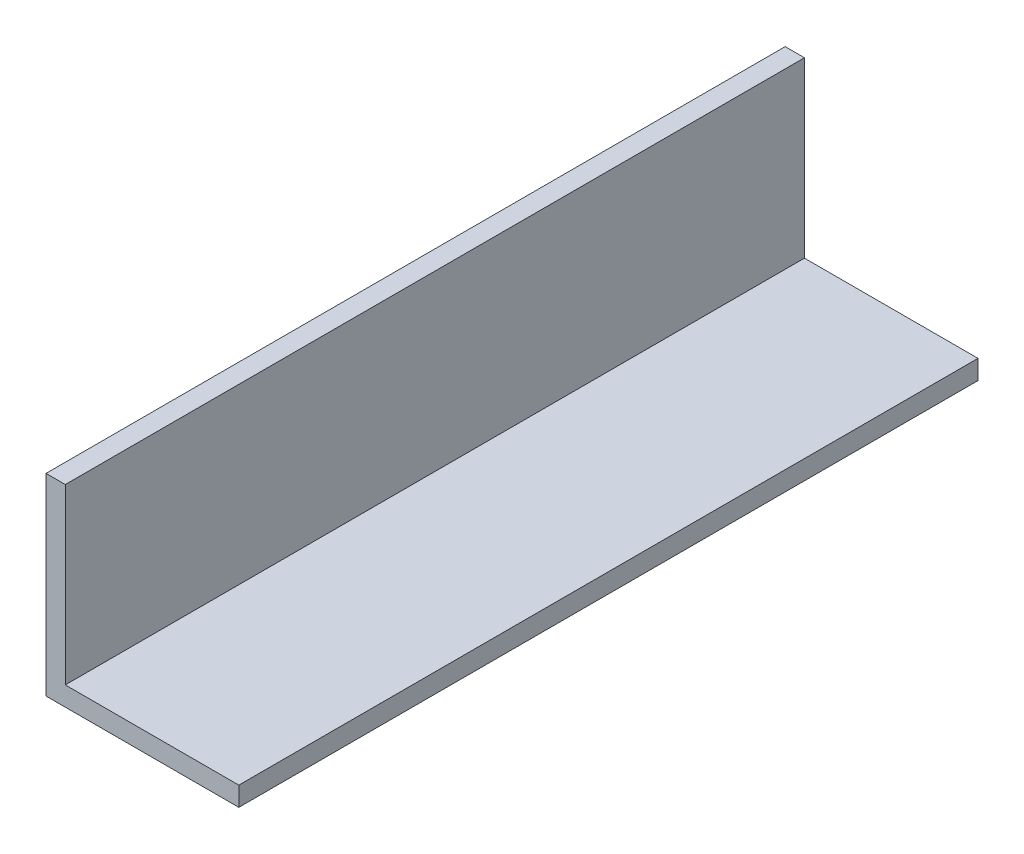
ISO-10303-21;
HEADER;
FILE_DESCRIPTION(('STEP AP214'),'2;1');
FILE_NAME('part.step','',(''),(''),'','','');
FILE_SCHEMA(('AUTOMOTIVE_DESIGN { 1 0 10303 214 1 1 1 1 }'));
ENDSEC;
DATA;
#1=APPLICATION_CONTEXT('core data for automotive mechanical design processes');
#2=APPLICATION_PROTOCOL_DEFINITION('international standard','automotive_design',2000,#1);
#3=PRODUCT_CONTEXT('',#1,'mechanical');
#4=PRODUCT('Part','Part','',(#3));
#5=PRODUCT_RELATED_PRODUCT_CATEGORY('part','',(#4));
#6=PRODUCT_DEFINITION_FORMATION('','',#4);
#7=PRODUCT_DEFINITION_CONTEXT('part definition',#1,'design');
#8=PRODUCT_DEFINITION('design','',#6,#7);
#9=PRODUCT_DEFINITION_SHAPE('','',#8);
#10=(LENGTH_UNIT() NAMED_UNIT(*) SI_UNIT(.MILLI.,.METRE.));
#11=(NAMED_UNIT(*) PLANE_ANGLE_UNIT() SI_UNIT($,.RADIAN.));
#12=(NAMED_UNIT(*) SI_UNIT($,.STERADIAN.) SOLID_ANGLE_UNIT());
#13=UNCERTAINTY_MEASURE_WITH_UNIT(LENGTH_MEASURE(1.E-05),#10,'distance_accuracy_value','');
#14=(GEOMETRIC_REPRESENTATION_CONTEXT(3) GLOBAL_UNCERTAINTY_ASSIGNED_CONTEXT((#13)) GLOBAL_UNIT_ASSIGNED_CONTEXT((#10,
#11,#12)) REPRESENTATION_CONTEXT('',''));
#15=CARTESIAN_POINT('',(0.,0.,0.));
#16=DIRECTION('',(0.,0.,1.));
#17=DIRECTION('',(1.,0.,0.));
#18=AXIS2_PLACEMENT_3D('',#15,#16,#17);
#19=CARTESIAN_POINT('',(0.,30.,115.));
#20=DIRECTION('',(0.,-1.,0.));
#21=DIRECTION('',(0.,0.,-1.));
#22=AXIS2_PLACEMENT_3D('',#19,#20,#21);
#23=PLANE('',#22);
#24=DIRECTION('',(-1.,0.,0.));
#25=VECTOR('',#24,1.);
#26=CARTESIAN_POINT('',(0.,30.,0.));
#27=LINE('',#26,#25);
#28=CARTESIAN_POINT('',(3.,30.,0.));
#29=VERTEX_POINT('',#28);
#30=CARTESIAN_POINT('',(0.,30.,0.));
#31=VERTEX_POINT('',#30);
#32=EDGE_CURVE('E119',#29,#31,#27,.T.);
#33=ORIENTED_EDGE('',*,*,#32,.T.);
#34=DIRECTION('',(0.,0.,-1.));
#35=VECTOR('',#34,1.);
#36=CARTESIAN_POINT('',(0.,30.,115.));
#37=LINE('',#36,#35);
#38=CARTESIAN_POINT('',(0.,30.,115.));
#39=VERTEX_POINT('',#38);
#40=EDGE_CURVE('E11',#39,#31,#37,.T.);
#41=ORIENTED_EDGE('',*,*,#40,.F.);
#42=DIRECTION('',(-1.,0.,0.));
#43=VECTOR('',#42,1.);
#44=CARTESIAN_POINT('',(0.,30.,115.));
#45=LINE('',#44,#43);
#46=CARTESIAN_POINT('',(3.,30.,115.));
#47=VERTEX_POINT('',#46);
#48=EDGE_CURVE('E129',#47,#39,#45,.T.);
#49=ORIENTED_EDGE('',*,*,#48,.F.);
#50=DIRECTION('',(0.,0.,-1.));
#51=VECTOR('',#50,1.);
#52=CARTESIAN_POINT('',(3.,30.,115.));
#53=LINE('',#52,#51);
#54=EDGE_CURVE('E115',#47,#29,#53,.T.);
#55=ORIENTED_EDGE('',*,*,#54,.T.);
#56=EDGE_LOOP('',(#33,#41,#49,#55));
#57=FACE_BOUND('',#56,.T.);
#58=ADVANCED_FACE('F35',(#57),#23,.F.);
#59=CARTESIAN_POINT('',(0.,30.,115.));
#60=DIRECTION('',(1.,0.,0.));
#61=DIRECTION('',(0.,1.,0.));
#62=AXIS2_PLACEMENT_3D('',#59,#60,#61);
#63=PLANE('',#62);
#64=DIRECTION('',(0.,-1.,0.));
#65=VECTOR('',#64,1.);
#66=CARTESIAN_POINT('',(0.,30.,0.));
#67=LINE('',#66,#65);
#68=CARTESIAN_POINT('',(0.,0.,0.));
#69=VERTEX_POINT('',#68);
#70=EDGE_CURVE('E122',#31,#69,#67,.T.);
#71=ORIENTED_EDGE('',*,*,#70,.T.);
#72=DIRECTION('',(0.,0.,-1.));
#73=VECTOR('',#72,1.);
#74=CARTESIAN_POINT('',(0.,0.,115.));
#75=LINE('',#74,#73);
#76=CARTESIAN_POINT('',(0.,0.,115.));
#77=VERTEX_POINT('',#76);
#78=EDGE_CURVE('E43',#77,#69,#75,.T.);
#79=ORIENTED_EDGE('',*,*,#78,.F.);
#80=DIRECTION('',(0.,-1.,0.));
#81=VECTOR('',#80,1.);
#82=CARTESIAN_POINT('',(0.,30.,115.));
#83=LINE('',#82,#81);
#84=EDGE_CURVE('E88',#39,#77,#83,.T.);
#85=ORIENTED_EDGE('',*,*,#84,.F.);
#86=ORIENTED_EDGE('',*,*,#40,.T.);
#87=EDGE_LOOP('',(#71,#79,#85,#86));
#88=FACE_BOUND('',#87,.T.);
#89=ADVANCED_FACE('F153',(#88),#63,.F.);
#90=CARTESIAN_POINT('',(0.,0.,115.));
#91=DIRECTION('',(0.,1.,0.));
#92=DIRECTION('',(0.,0.,1.));
#93=AXIS2_PLACEMENT_3D('',#90,#91,#92);
#94=PLANE('',#93);
#95=DIRECTION('',(1.,0.,0.));
#96=VECTOR('',#95,1.);
#97=CARTESIAN_POINT('',(0.,0.,0.));
#98=LINE('',#97,#96);
#99=CARTESIAN_POINT('',(30.,0.,0.));
#100=VERTEX_POINT('',#99);
#101=EDGE_CURVE('E124',#69,#100,#98,.T.);
#102=ORIENTED_EDGE('',*,*,#101,.T.);
#103=DIRECTION('',(0.,0.,-1.));
#104=VECTOR('',#103,1.);
#105=CARTESIAN_POINT('',(30.,0.,115.));
#106=LINE('',#105,#104);
#107=CARTESIAN_POINT('',(30.,0.,115.));
#108=VERTEX_POINT('',#107);
#109=EDGE_CURVE('E110',#108,#100,#106,.T.);
#110=ORIENTED_EDGE('',*,*,#109,.F.);
#111=DIRECTION('',(1.,0.,0.));
#112=VECTOR('',#111,1.);
#113=CARTESIAN_POINT('',(0.,0.,115.));
#114=LINE('',#113,#112);
#115=EDGE_CURVE('E101',#77,#108,#114,.T.);
#116=ORIENTED_EDGE('',*,*,#115,.F.);
#117=ORIENTED_EDGE('',*,*,#78,.T.);
#118=EDGE_LOOP('',(#102,#110,#116,#117));
#119=FACE_BOUND('',#118,.T.);
#120=ADVANCED_FACE('F135',(#119),#94,.F.);
#121=CARTESIAN_POINT('',(30.,3.,115.));
#122=DIRECTION('',(-1.,0.,0.));
#123=DIRECTION('',(0.,0.,1.));
#124=AXIS2_PLACEMENT_3D('',#121,#122,#123);
#125=PLANE('',#124);
#126=DIRECTION('',(0.,1.,0.));
#127=VECTOR('',#126,1.);
#128=CARTESIAN_POINT('',(30.,3.,0.));
#129=LINE('',#128,#127);
#130=CARTESIAN_POINT('',(30.,3.,0.));
#131=VERTEX_POINT('',#130);
#132=EDGE_CURVE('E109',#100,#131,#129,.T.);
#133=ORIENTED_EDGE('',*,*,#132,.T.);
#134=DIRECTION('',(0.,0.,-1.));
#135=VECTOR('',#134,1.);
#136=CARTESIAN_POINT('',(30.,3.,115.));
#137=LINE('',#136,#135);
#138=CARTESIAN_POINT('',(30.,3.,115.));
#139=VERTEX_POINT('',#138);
#140=EDGE_CURVE('E106',#139,#131,#137,.T.);
#141=ORIENTED_EDGE('',*,*,#140,.F.);
#142=DIRECTION('',(0.,1.,0.));
#143=VECTOR('',#142,1.);
#144=CARTESIAN_POINT('',(30.,3.,115.));
#145=LINE('',#144,#143);
#146=EDGE_CURVE('E95',#108,#139,#145,.T.);
#147=ORIENTED_EDGE('',*,*,#146,.F.);
#148=ORIENTED_EDGE('',*,*,#109,.T.);
#149=EDGE_LOOP('',(#133,#141,#147,#148));
#150=FACE_BOUND('',#149,.T.);
#151=ADVANCED_FACE('F107',(#150),#125,.F.);
#152=CARTESIAN_POINT('',(3.,3.,115.));
#153=DIRECTION('',(0.,-1.,0.));
#154=DIRECTION('',(0.,0.,-1.));
#155=AXIS2_PLACEMENT_3D('',#152,#153,#154);
#156=PLANE('',#155);
#157=DIRECTION('',(-1.,0.,0.));
#158=VECTOR('',#157,1.);
#159=CARTESIAN_POINT('',(3.,3.,0.));
#160=LINE('',#159,#158);
#161=CARTESIAN_POINT('',(3.,3.,0.));
#162=VERTEX_POINT('',#161);
#163=EDGE_CURVE('E74',#131,#162,#160,.T.);
#164=ORIENTED_EDGE('',*,*,#163,.T.);
#165=DIRECTION('',(0.,0.,-1.));
#166=VECTOR('',#165,1.);
#167=CARTESIAN_POINT('',(3.,3.,115.));
#168=LINE('',#167,#166);
#169=CARTESIAN_POINT('',(3.,3.,115.));
#170=VERTEX_POINT('',#169);
#171=EDGE_CURVE('E111',#170,#162,#168,.T.);
#172=ORIENTED_EDGE('',*,*,#171,.F.);
#173=DIRECTION('',(-1.,0.,0.));
#174=VECTOR('',#173,1.);
#175=CARTESIAN_POINT('',(3.,3.,115.));
#176=LINE('',#175,#174);
#177=EDGE_CURVE('E99',#139,#170,#176,.T.);
#178=ORIENTED_EDGE('',*,*,#177,.F.);
#179=ORIENTED_EDGE('',*,*,#140,.T.);
#180=EDGE_LOOP('',(#164,#172,#178,#179));
#181=FACE_BOUND('',#180,.T.);
#182=ADVANCED_FACE('F113',(#181),#156,.F.);
#183=CARTESIAN_POINT('',(3.,30.,115.));
#184=DIRECTION('',(-1.,0.,0.));
#185=DIRECTION('',(0.,-1.,0.));
#186=AXIS2_PLACEMENT_3D('',#183,#184,#185);
#187=PLANE('',#186);
#188=DIRECTION('',(0.,1.,0.));
#189=VECTOR('',#188,1.);
#190=CARTESIAN_POINT('',(3.,30.,0.));
#191=LINE('',#190,#189);
#192=EDGE_CURVE('E80',#162,#29,#191,.T.);
#193=ORIENTED_EDGE('',*,*,#192,.T.);
#194=ORIENTED_EDGE('',*,*,#54,.F.);
#195=DIRECTION('',(0.,1.,0.));
#196=VECTOR('',#195,1.);
#197=CARTESIAN_POINT('',(3.,30.,115.));
#198=LINE('',#197,#196);
#199=EDGE_CURVE('E51',#170,#47,#198,.T.);
#200=ORIENTED_EDGE('',*,*,#199,.F.);
#201=ORIENTED_EDGE('',*,*,#171,.T.);
#202=EDGE_LOOP('',(#193,#194,#200,#201));
#203=FACE_BOUND('',#202,.T.);
#204=ADVANCED_FACE('F142',(#203),#187,.F.);
#205=CARTESIAN_POINT('',(0.,0.,115.));
#206=DIRECTION('',(0.,0.,-1.));
#207=DIRECTION('',(-1.,0.,0.));
#208=AXIS2_PLACEMENT_3D('',#205,#206,#207);
#209=PLANE('',#208);
#210=ORIENTED_EDGE('',*,*,#48,.T.);
#211=ORIENTED_EDGE('',*,*,#84,.T.);
#212=ORIENTED_EDGE('',*,*,#115,.T.);
#213=ORIENTED_EDGE('',*,*,#146,.T.);
#214=ORIENTED_EDGE('',*,*,#177,.T.);
#215=ORIENTED_EDGE('',*,*,#199,.T.);
#216=EDGE_LOOP('',(#210,#211,#212,#213,#214,#215));
#217=FACE_BOUND('',#216,.T.);
#218=ADVANCED_FACE('F97',(#217),#209,.F.);
#219=CARTESIAN_POINT('',(0.,0.,0.));
#220=DIRECTION('',(0.,0.,-1.));
#221=DIRECTION('',(-1.,0.,0.));
#222=AXIS2_PLACEMENT_3D('',#219,#220,#221);
#223=PLANE('',#222);
#224=ORIENTED_EDGE('',*,*,#32,.F.);
#225=ORIENTED_EDGE('',*,*,#192,.F.);
#226=ORIENTED_EDGE('',*,*,#163,.F.);
#227=ORIENTED_EDGE('',*,*,#132,.F.);
#228=ORIENTED_EDGE('',*,*,#101,.F.);
#229=ORIENTED_EDGE('',*,*,#70,.F.);
#230=EDGE_LOOP('',(#224,#225,#226,#227,#228,#229));
#231=FACE_BOUND('',#230,.T.);
#232=ADVANCED_FACE('F138',(#231),#223,.T.);
#233=CLOSED_SHELL('',(#58,#89,#120,#151,#182,#204,#218,#232));
#234=MANIFOLD_SOLID_BREP('B2',#233);
#235=ADVANCED_BREP_SHAPE_REPRESENTATION('',(#18,#234),#14);
#236=SHAPE_DEFINITION_REPRESENTATION(#9,#235);
ENDSEC;
END-ISO-10303-21;
